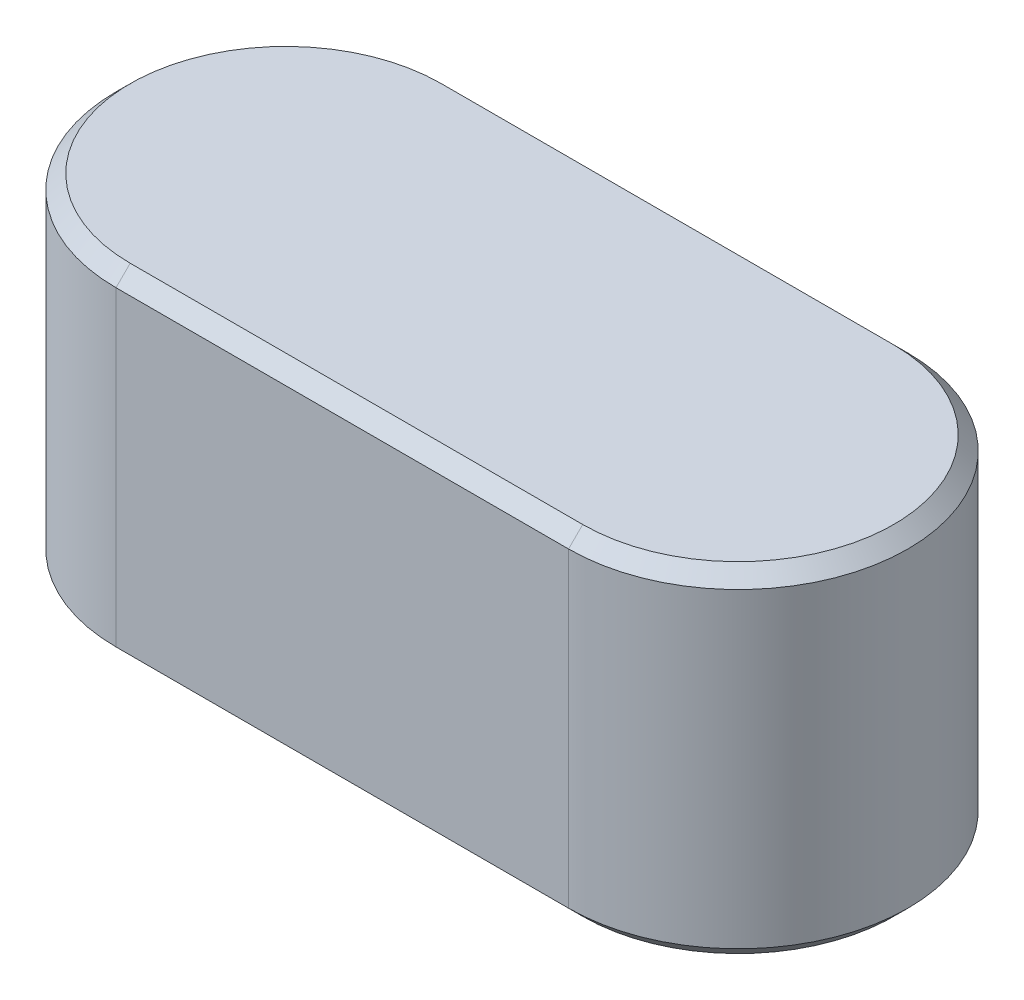
ISO-10303-21;
HEADER;
FILE_DESCRIPTION(('STEP AP214'),'2;1');
FILE_NAME('part.step','',(''),(''),'','','');
FILE_SCHEMA(('AUTOMOTIVE_DESIGN { 1 0 10303 214 1 1 1 1 }'));
ENDSEC;
DATA;
#1=APPLICATION_CONTEXT('core data for automotive mechanical design processes');
#2=APPLICATION_PROTOCOL_DEFINITION('international standard','automotive_design',2000,#1);
#3=PRODUCT_CONTEXT('',#1,'mechanical');
#4=PRODUCT('Part','Part','',(#3));
#5=PRODUCT_RELATED_PRODUCT_CATEGORY('part','',(#4));
#6=PRODUCT_DEFINITION_FORMATION('','',#4);
#7=PRODUCT_DEFINITION_CONTEXT('part definition',#1,'design');
#8=PRODUCT_DEFINITION('design','',#6,#7);
#9=PRODUCT_DEFINITION_SHAPE('','',#8);
#10=(LENGTH_UNIT() NAMED_UNIT(*) SI_UNIT(.MILLI.,.METRE.));
#11=(NAMED_UNIT(*) PLANE_ANGLE_UNIT() SI_UNIT($,.RADIAN.));
#12=(NAMED_UNIT(*) SI_UNIT($,.STERADIAN.) SOLID_ANGLE_UNIT());
#13=UNCERTAINTY_MEASURE_WITH_UNIT(LENGTH_MEASURE(1.E-05),#10,'distance_accuracy_value','');
#14=(GEOMETRIC_REPRESENTATION_CONTEXT(3) GLOBAL_UNCERTAINTY_ASSIGNED_CONTEXT((#13)) GLOBAL_UNIT_ASSIGNED_CONTEXT((#10,
#11,#12)) REPRESENTATION_CONTEXT('',''));
#15=CARTESIAN_POINT('',(0.,0.,0.));
#16=DIRECTION('',(0.,0.,1.));
#17=DIRECTION('',(1.,0.,0.));
#18=AXIS2_PLACEMENT_3D('',#15,#16,#17);
#19=CARTESIAN_POINT('',(11.,0.,0.));
#20=DIRECTION('',(0.,-1.,0.));
#21=DIRECTION('',(0.,0.,-1.));
#22=AXIS2_PLACEMENT_3D('',#19,#20,#21);
#23=CYLINDRICAL_SURFACE('',#22,3.);
#24=DIRECTION('',(0.,-1.,0.));
#25=VECTOR('',#24,1.);
#26=CARTESIAN_POINT('',(11.,6.,3.));
#27=LINE('',#26,#25);
#28=CARTESIAN_POINT('',(11.,0.25,3.));
#29=VERTEX_POINT('',#28);
#30=CARTESIAN_POINT('',(11.,5.75,3.));
#31=VERTEX_POINT('',#30);
#32=EDGE_CURVE('E123',#29,#31,#27,.F.);
#33=ORIENTED_EDGE('',*,*,#32,.F.);
#34=CARTESIAN_POINT('',(11.,0.25,0.));
#35=DIRECTION('',(0.,-1.,0.));
#36=DIRECTION('',(0.,0.,-1.));
#37=AXIS2_PLACEMENT_3D('',#34,#35,#36);
#38=CIRCLE('',#37,3.);
#39=CARTESIAN_POINT('',(11.,0.25,-3.));
#40=VERTEX_POINT('',#39);
#41=EDGE_CURVE('E122',#29,#40,#38,.F.);
#42=ORIENTED_EDGE('',*,*,#41,.T.);
#43=DIRECTION('',(0.,-1.,0.));
#44=VECTOR('',#43,1.);
#45=CARTESIAN_POINT('',(11.,6.,-3.));
#46=LINE('',#45,#44);
#47=CARTESIAN_POINT('',(11.,5.75,-3.));
#48=VERTEX_POINT('',#47);
#49=EDGE_CURVE('E106',#48,#40,#46,.T.);
#50=ORIENTED_EDGE('',*,*,#49,.F.);
#51=CARTESIAN_POINT('',(11.,5.75,0.));
#52=DIRECTION('',(0.,-1.,0.));
#53=DIRECTION('',(0.,0.,-1.));
#54=AXIS2_PLACEMENT_3D('',#51,#52,#53);
#55=CIRCLE('',#54,3.);
#56=EDGE_CURVE('E119',#48,#31,#55,.T.);
#57=ORIENTED_EDGE('',*,*,#56,.T.);
#58=EDGE_LOOP('',(#33,#42,#50,#57));
#59=FACE_BOUND('',#58,.T.);
#60=ADVANCED_FACE('F34',(#59),#23,.T.);
#61=CARTESIAN_POINT('',(3.,6.,0.));
#62=DIRECTION('',(0.,-1.,0.));
#63=DIRECTION('',(0.,0.,-1.));
#64=AXIS2_PLACEMENT_3D('',#61,#62,#63);
#65=CYLINDRICAL_SURFACE('',#64,3.);
#66=DIRECTION('',(0.,-1.,0.));
#67=VECTOR('',#66,1.);
#68=CARTESIAN_POINT('',(3.,6.,-3.));
#69=LINE('',#68,#67);
#70=CARTESIAN_POINT('',(3.,0.25,-3.));
#71=VERTEX_POINT('',#70);
#72=CARTESIAN_POINT('',(3.,5.75,-3.));
#73=VERTEX_POINT('',#72);
#74=EDGE_CURVE('E109',#71,#73,#69,.F.);
#75=ORIENTED_EDGE('',*,*,#74,.F.);
#76=CARTESIAN_POINT('',(3.,0.25,0.));
#77=DIRECTION('',(0.,-1.,0.));
#78=DIRECTION('',(0.,0.,-1.));
#79=AXIS2_PLACEMENT_3D('',#76,#77,#78);
#80=CIRCLE('',#79,3.);
#81=CARTESIAN_POINT('',(3.,0.25,3.));
#82=VERTEX_POINT('',#81);
#83=EDGE_CURVE('E160',#71,#82,#80,.F.);
#84=ORIENTED_EDGE('',*,*,#83,.T.);
#85=DIRECTION('',(0.,-1.,0.));
#86=VECTOR('',#85,1.);
#87=CARTESIAN_POINT('',(3.,6.,3.));
#88=LINE('',#87,#86);
#89=CARTESIAN_POINT('',(3.,5.75,3.));
#90=VERTEX_POINT('',#89);
#91=EDGE_CURVE('E147',#90,#82,#88,.T.);
#92=ORIENTED_EDGE('',*,*,#91,.F.);
#93=CARTESIAN_POINT('',(3.,5.75,0.));
#94=DIRECTION('',(0.,-1.,0.));
#95=DIRECTION('',(0.,0.,-1.));
#96=AXIS2_PLACEMENT_3D('',#93,#94,#95);
#97=CIRCLE('',#96,3.);
#98=EDGE_CURVE('E162',#90,#73,#97,.T.);
#99=ORIENTED_EDGE('',*,*,#98,.T.);
#100=EDGE_LOOP('',(#75,#84,#92,#99));
#101=FACE_BOUND('',#100,.T.);
#102=ADVANCED_FACE('F210',(#101),#65,.T.);
#103=CARTESIAN_POINT('',(0.,6.,-3.));
#104=DIRECTION('',(0.,0.,1.));
#105=DIRECTION('',(1.,0.,0.));
#106=AXIS2_PLACEMENT_3D('',#103,#104,#105);
#107=PLANE('',#106);
#108=ORIENTED_EDGE('',*,*,#49,.T.);
#109=DIRECTION('',(-1.,0.,0.));
#110=VECTOR('',#109,1.);
#111=CARTESIAN_POINT('',(3.,0.25,-3.));
#112=LINE('',#111,#110);
#113=EDGE_CURVE('E114',#40,#71,#112,.T.);
#114=ORIENTED_EDGE('',*,*,#113,.T.);
#115=ORIENTED_EDGE('',*,*,#74,.T.);
#116=DIRECTION('',(1.,0.,0.));
#117=VECTOR('',#116,1.);
#118=CARTESIAN_POINT('',(0.,5.75,-3.));
#119=LINE('',#118,#117);
#120=EDGE_CURVE('E102',#73,#48,#119,.T.);
#121=ORIENTED_EDGE('',*,*,#120,.T.);
#122=EDGE_LOOP('',(#108,#114,#115,#121));
#123=FACE_BOUND('',#122,.T.);
#124=ADVANCED_FACE('F104',(#123),#107,.F.);
#125=CARTESIAN_POINT('',(14.,6.,3.));
#126=DIRECTION('',(0.,0.,-1.));
#127=DIRECTION('',(-1.,0.,0.));
#128=AXIS2_PLACEMENT_3D('',#125,#126,#127);
#129=PLANE('',#128);
#130=ORIENTED_EDGE('',*,*,#91,.T.);
#131=DIRECTION('',(1.,0.,0.));
#132=VECTOR('',#131,1.);
#133=CARTESIAN_POINT('',(11.,0.25,3.));
#134=LINE('',#133,#132);
#135=EDGE_CURVE('E156',#82,#29,#134,.T.);
#136=ORIENTED_EDGE('',*,*,#135,.T.);
#137=ORIENTED_EDGE('',*,*,#32,.T.);
#138=DIRECTION('',(-1.,0.,0.));
#139=VECTOR('',#138,1.);
#140=CARTESIAN_POINT('',(14.,5.75,3.));
#141=LINE('',#140,#139);
#142=EDGE_CURVE('E158',#31,#90,#141,.T.);
#143=ORIENTED_EDGE('',*,*,#142,.T.);
#144=EDGE_LOOP('',(#130,#136,#137,#143));
#145=FACE_BOUND('',#144,.T.);
#146=ADVANCED_FACE('F180',(#145),#129,.F.);
#147=CARTESIAN_POINT('',(14.,6.,-3.));
#148=DIRECTION('',(0.,-1.,0.));
#149=DIRECTION('',(0.,0.,-1.));
#150=AXIS2_PLACEMENT_3D('',#147,#148,#149);
#151=PLANE('',#150);
#152=DIRECTION('',(-1.,0.,0.));
#153=VECTOR('',#152,1.);
#154=CARTESIAN_POINT('',(14.,6.,-2.75));
#155=LINE('',#154,#153);
#156=CARTESIAN_POINT('',(11.,6.,-2.75));
#157=VERTEX_POINT('',#156);
#158=CARTESIAN_POINT('',(3.,6.,-2.75));
#159=VERTEX_POINT('',#158);
#160=EDGE_CURVE('E135',#157,#159,#155,.T.);
#161=ORIENTED_EDGE('',*,*,#160,.T.);
#162=CARTESIAN_POINT('',(3.,6.,0.));
#163=DIRECTION('',(0.,-1.,0.));
#164=DIRECTION('',(0.,0.,-1.));
#165=AXIS2_PLACEMENT_3D('',#162,#163,#164);
#166=CIRCLE('',#165,2.75);
#167=CARTESIAN_POINT('',(3.,6.,2.75));
#168=VERTEX_POINT('',#167);
#169=EDGE_CURVE('E11',#159,#168,#166,.F.);
#170=ORIENTED_EDGE('',*,*,#169,.T.);
#171=DIRECTION('',(1.,0.,0.));
#172=VECTOR('',#171,1.);
#173=CARTESIAN_POINT('',(14.,6.,2.75));
#174=LINE('',#173,#172);
#175=CARTESIAN_POINT('',(11.,6.,2.75));
#176=VERTEX_POINT('',#175);
#177=EDGE_CURVE('E43',#168,#176,#174,.T.);
#178=ORIENTED_EDGE('',*,*,#177,.T.);
#179=CARTESIAN_POINT('',(11.,6.,0.));
#180=DIRECTION('',(0.,-1.,0.));
#181=DIRECTION('',(0.,0.,-1.));
#182=AXIS2_PLACEMENT_3D('',#179,#180,#181);
#183=CIRCLE('',#182,2.75);
#184=EDGE_CURVE('E153',#176,#157,#183,.F.);
#185=ORIENTED_EDGE('',*,*,#184,.T.);
#186=EDGE_LOOP('',(#161,#170,#178,#185));
#187=FACE_BOUND('',#186,.T.);
#188=ADVANCED_FACE('F235',(#187),#151,.F.);
#189=CARTESIAN_POINT('',(14.,0.,-3.));
#190=DIRECTION('',(0.,-1.,0.));
#191=DIRECTION('',(0.,0.,-1.));
#192=AXIS2_PLACEMENT_3D('',#189,#190,#191);
#193=PLANE('',#192);
#194=CARTESIAN_POINT('',(3.,0.,0.));
#195=DIRECTION('',(0.,-1.,0.));
#196=DIRECTION('',(0.,0.,-1.));
#197=AXIS2_PLACEMENT_3D('',#194,#195,#196);
#198=CIRCLE('',#197,2.75);
#199=CARTESIAN_POINT('',(3.,0.,2.75));
#200=VERTEX_POINT('',#199);
#201=CARTESIAN_POINT('',(3.,0.,-2.75));
#202=VERTEX_POINT('',#201);
#203=EDGE_CURVE('E169',#200,#202,#198,.T.);
#204=ORIENTED_EDGE('',*,*,#203,.T.);
#205=DIRECTION('',(1.,0.,0.));
#206=VECTOR('',#205,1.);
#207=CARTESIAN_POINT('',(11.,0.,-2.75));
#208=LINE('',#207,#206);
#209=CARTESIAN_POINT('',(11.,0.,-2.75));
#210=VERTEX_POINT('',#209);
#211=EDGE_CURVE('E132',#202,#210,#208,.T.);
#212=ORIENTED_EDGE('',*,*,#211,.T.);
#213=CARTESIAN_POINT('',(11.,0.,0.));
#214=DIRECTION('',(0.,-1.,0.));
#215=DIRECTION('',(0.,0.,-1.));
#216=AXIS2_PLACEMENT_3D('',#213,#214,#215);
#217=CIRCLE('',#216,2.75);
#218=CARTESIAN_POINT('',(11.,0.,2.75));
#219=VERTEX_POINT('',#218);
#220=EDGE_CURVE('E167',#210,#219,#217,.T.);
#221=ORIENTED_EDGE('',*,*,#220,.T.);
#222=DIRECTION('',(-1.,0.,0.));
#223=VECTOR('',#222,1.);
#224=CARTESIAN_POINT('',(3.,0.,2.75));
#225=LINE('',#224,#223);
#226=EDGE_CURVE('E171',#219,#200,#225,.T.);
#227=ORIENTED_EDGE('',*,*,#226,.T.);
#228=EDGE_LOOP('',(#204,#212,#221,#227));
#229=FACE_BOUND('',#228,.T.);
#230=ADVANCED_FACE('F194',(#229),#193,.T.);
#231=CARTESIAN_POINT('',(14.,0.25,3.));
#232=DIRECTION('',(0.,-0.70710678118655,0.707106781186545));
#233=DIRECTION('',(0.,-0.707106781186545,-0.70710678118655));
#234=AXIS2_PLACEMENT_3D('',#231,#232,#233);
#235=PLANE('',#234);
#236=DIRECTION('',(0.,0.707106781186545,0.70710678118655));
#237=VECTOR('',#236,1.);
#238=CARTESIAN_POINT('',(3.,0.,2.75));
#239=LINE('',#238,#237);
#240=EDGE_CURVE('E148',#200,#82,#239,.T.);
#241=ORIENTED_EDGE('',*,*,#240,.F.);
#242=ORIENTED_EDGE('',*,*,#226,.F.);
#243=DIRECTION('',(0.,-0.707106781186545,-0.70710678118655));
#244=VECTOR('',#243,1.);
#245=CARTESIAN_POINT('',(11.,0.25,3.));
#246=LINE('',#245,#244);
#247=EDGE_CURVE('E144',#29,#219,#246,.T.);
#248=ORIENTED_EDGE('',*,*,#247,.F.);
#249=ORIENTED_EDGE('',*,*,#135,.F.);
#250=EDGE_LOOP('',(#241,#242,#248,#249));
#251=FACE_BOUND('',#250,.T.);
#252=ADVANCED_FACE('F185',(#251),#235,.T.);
#253=CARTESIAN_POINT('',(11.,0.,0.));
#254=DIRECTION('',(0.,1.,0.));
#255=DIRECTION('',(0.,0.,1.));
#256=AXIS2_PLACEMENT_3D('',#253,#254,#255);
#257=CONICAL_SURFACE('',#256,2.75,0.785398163397452);
#258=ORIENTED_EDGE('',*,*,#247,.T.);
#259=ORIENTED_EDGE('',*,*,#220,.F.);
#260=DIRECTION('',(0.,-0.707106781186545,0.70710678118655));
#261=VECTOR('',#260,1.);
#262=CARTESIAN_POINT('',(11.,0.25,-3.));
#263=LINE('',#262,#261);
#264=EDGE_CURVE('E137',#40,#210,#263,.T.);
#265=ORIENTED_EDGE('',*,*,#264,.F.);
#266=ORIENTED_EDGE('',*,*,#41,.F.);
#267=EDGE_LOOP('',(#258,#259,#265,#266));
#268=FACE_BOUND('',#267,.T.);
#269=ADVANCED_FACE('F200',(#268),#257,.T.);
#270=CARTESIAN_POINT('',(3.,0.,0.));
#271=DIRECTION('',(0.,1.,0.));
#272=DIRECTION('',(0.,0.,1.));
#273=AXIS2_PLACEMENT_3D('',#270,#271,#272);
#274=CONICAL_SURFACE('',#273,2.75,0.785398163397452);
#275=ORIENTED_EDGE('',*,*,#240,.T.);
#276=ORIENTED_EDGE('',*,*,#83,.F.);
#277=DIRECTION('',(0.,0.707106781186545,-0.70710678118655));
#278=VECTOR('',#277,1.);
#279=CARTESIAN_POINT('',(3.,0.,-2.75));
#280=LINE('',#279,#278);
#281=EDGE_CURVE('E136',#202,#71,#280,.T.);
#282=ORIENTED_EDGE('',*,*,#281,.F.);
#283=ORIENTED_EDGE('',*,*,#203,.F.);
#284=EDGE_LOOP('',(#275,#276,#282,#283));
#285=FACE_BOUND('',#284,.T.);
#286=ADVANCED_FACE('F190',(#285),#274,.T.);
#287=CARTESIAN_POINT('',(0.,0.25,-3.));
#288=DIRECTION('',(0.,-0.70710678118655,-0.707106781186545));
#289=DIRECTION('',(0.,0.707106781186545,-0.70710678118655));
#290=AXIS2_PLACEMENT_3D('',#287,#288,#289);
#291=PLANE('',#290);
#292=ORIENTED_EDGE('',*,*,#264,.T.);
#293=ORIENTED_EDGE('',*,*,#211,.F.);
#294=ORIENTED_EDGE('',*,*,#281,.T.);
#295=ORIENTED_EDGE('',*,*,#113,.F.);
#296=EDGE_LOOP('',(#292,#293,#294,#295));
#297=FACE_BOUND('',#296,.T.);
#298=ADVANCED_FACE('F196',(#297),#291,.T.);
#299=CARTESIAN_POINT('',(11.,6.,0.));
#300=DIRECTION('',(0.,-1.,0.));
#301=DIRECTION('',(0.,0.,-1.));
#302=AXIS2_PLACEMENT_3D('',#299,#300,#301);
#303=CONICAL_SURFACE('',#302,2.75,0.785398163397445);
#304=DIRECTION('',(0.,0.70710678118655,-0.707106781186545));
#305=VECTOR('',#304,1.);
#306=CARTESIAN_POINT('',(11.,5.75,3.));
#307=LINE('',#306,#305);
#308=EDGE_CURVE('E130',#31,#176,#307,.T.);
#309=ORIENTED_EDGE('',*,*,#308,.F.);
#310=ORIENTED_EDGE('',*,*,#56,.F.);
#311=DIRECTION('',(0.,-0.70710678118655,-0.707106781186545));
#312=VECTOR('',#311,1.);
#313=CARTESIAN_POINT('',(11.,6.,-2.75));
#314=LINE('',#313,#312);
#315=EDGE_CURVE('E38',#157,#48,#314,.T.);
#316=ORIENTED_EDGE('',*,*,#315,.F.);
#317=ORIENTED_EDGE('',*,*,#184,.F.);
#318=EDGE_LOOP('',(#309,#310,#316,#317));
#319=FACE_BOUND('',#318,.T.);
#320=ADVANCED_FACE('F36',(#319),#303,.T.);
#321=CARTESIAN_POINT('',(14.,6.,-2.75));
#322=DIRECTION('',(0.,-0.707106781186545,0.70710678118655));
#323=DIRECTION('',(0.,-0.70710678118655,-0.707106781186545));
#324=AXIS2_PLACEMENT_3D('',#321,#322,#323);
#325=PLANE('',#324);
#326=ORIENTED_EDGE('',*,*,#315,.T.);
#327=ORIENTED_EDGE('',*,*,#120,.F.);
#328=DIRECTION('',(0.,-0.70710678118655,-0.707106781186545));
#329=VECTOR('',#328,1.);
#330=CARTESIAN_POINT('',(3.,6.,-2.75));
#331=LINE('',#330,#329);
#332=EDGE_CURVE('E139',#159,#73,#331,.T.);
#333=ORIENTED_EDGE('',*,*,#332,.F.);
#334=ORIENTED_EDGE('',*,*,#160,.F.);
#335=EDGE_LOOP('',(#326,#327,#333,#334));
#336=FACE_BOUND('',#335,.T.);
#337=ADVANCED_FACE('F134',(#336),#325,.F.);
#338=CARTESIAN_POINT('',(14.,6.,2.75));
#339=DIRECTION('',(0.,-0.707106781186545,-0.70710678118655));
#340=DIRECTION('',(0.,0.70710678118655,-0.707106781186545));
#341=AXIS2_PLACEMENT_3D('',#338,#339,#340);
#342=PLANE('',#341);
#343=ORIENTED_EDGE('',*,*,#308,.T.);
#344=ORIENTED_EDGE('',*,*,#177,.F.);
#345=DIRECTION('',(0.,0.70710678118655,-0.707106781186545));
#346=VECTOR('',#345,1.);
#347=CARTESIAN_POINT('',(3.,5.75,3.));
#348=LINE('',#347,#346);
#349=EDGE_CURVE('E51',#90,#168,#348,.T.);
#350=ORIENTED_EDGE('',*,*,#349,.F.);
#351=ORIENTED_EDGE('',*,*,#142,.F.);
#352=EDGE_LOOP('',(#343,#344,#350,#351));
#353=FACE_BOUND('',#352,.T.);
#354=ADVANCED_FACE('F225',(#353),#342,.F.);
#355=CARTESIAN_POINT('',(3.,6.,0.));
#356=DIRECTION('',(0.,-1.,0.));
#357=DIRECTION('',(0.,0.,-1.));
#358=AXIS2_PLACEMENT_3D('',#355,#356,#357);
#359=CONICAL_SURFACE('',#358,2.75,0.785398163397445);
#360=ORIENTED_EDGE('',*,*,#332,.T.);
#361=ORIENTED_EDGE('',*,*,#98,.F.);
#362=ORIENTED_EDGE('',*,*,#349,.T.);
#363=ORIENTED_EDGE('',*,*,#169,.F.);
#364=EDGE_LOOP('',(#360,#361,#362,#363));
#365=FACE_BOUND('',#364,.T.);
#366=ADVANCED_FACE('F229',(#365),#359,.T.);
#367=CLOSED_SHELL('',(#60,#102,#124,#146,#188,#230,#252,#269,#286,#298,#320,#337,#354,#366));
#368=MANIFOLD_SOLID_BREP('B2',#367);
#369=ADVANCED_BREP_SHAPE_REPRESENTATION('',(#18,#368),#14);
#370=SHAPE_DEFINITION_REPRESENTATION(#9,#369);
ENDSEC;
END-ISO-10303-21;
